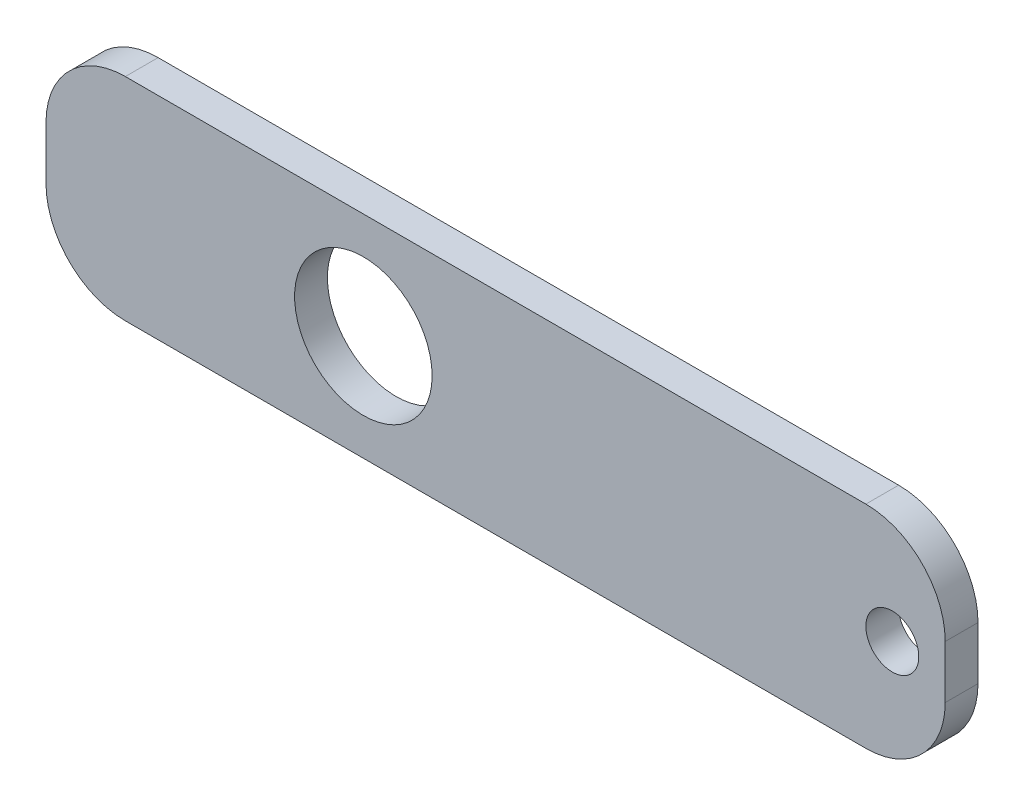
ISO-10303-21;
HEADER;
FILE_DESCRIPTION(('STEP AP214'),'2;1');
FILE_NAME('part.step','',(''),(''),'','','');
FILE_SCHEMA(('AUTOMOTIVE_DESIGN { 1 0 10303 214 1 1 1 1 }'));
ENDSEC;
DATA;
#1=APPLICATION_CONTEXT('core data for automotive mechanical design processes');
#2=APPLICATION_PROTOCOL_DEFINITION('international standard','automotive_design',2000,#1);
#3=PRODUCT_CONTEXT('',#1,'mechanical');
#4=PRODUCT('Part','Part','',(#3));
#5=PRODUCT_RELATED_PRODUCT_CATEGORY('part','',(#4));
#6=PRODUCT_DEFINITION_FORMATION('','',#4);
#7=PRODUCT_DEFINITION_CONTEXT('part definition',#1,'design');
#8=PRODUCT_DEFINITION('design','',#6,#7);
#9=PRODUCT_DEFINITION_SHAPE('','',#8);
#10=(LENGTH_UNIT() NAMED_UNIT(*) SI_UNIT(.MILLI.,.METRE.));
#11=(NAMED_UNIT(*) PLANE_ANGLE_UNIT() SI_UNIT($,.RADIAN.));
#12=(NAMED_UNIT(*) SI_UNIT($,.STERADIAN.) SOLID_ANGLE_UNIT());
#13=UNCERTAINTY_MEASURE_WITH_UNIT(LENGTH_MEASURE(1.E-05),#10,'distance_accuracy_value','');
#14=(GEOMETRIC_REPRESENTATION_CONTEXT(3) GLOBAL_UNCERTAINTY_ASSIGNED_CONTEXT((#13)) GLOBAL_UNIT_ASSIGNED_CONTEXT((#10,
#11,#12)) REPRESENTATION_CONTEXT('',''));
#15=CARTESIAN_POINT('',(0.,0.,0.));
#16=DIRECTION('',(0.,0.,1.));
#17=DIRECTION('',(1.,0.,0.));
#18=AXIS2_PLACEMENT_3D('',#15,#16,#17);
#19=CARTESIAN_POINT('',(0.,0.,3.1));
#20=DIRECTION('',(0.,0.,-1.));
#21=DIRECTION('',(-1.,0.,0.));
#22=AXIS2_PLACEMENT_3D('',#19,#20,#21);
#23=PLANE('',#22);
#24=CARTESIAN_POINT('',(32.3806232903625,0.,3.1));
#25=DIRECTION('',(0.,0.,1.));
#26=DIRECTION('',(-1.,0.,0.));
#27=AXIS2_PLACEMENT_3D('',#24,#25,#26);
#28=CIRCLE('',#27,2.5);
#29=CARTESIAN_POINT('',(29.8806232903625,0.,3.1));
#30=VERTEX_POINT('',#29);
#31=EDGE_CURVE('E134',#30,#30,#28,.T.);
#32=ORIENTED_EDGE('',*,*,#31,.F.);
#33=EDGE_LOOP('',(#32));
#34=FACE_BOUND('',#33,.T.);
#35=DIRECTION('',(0.,-1.,0.));
#36=VECTOR('',#35,1.);
#37=CARTESIAN_POINT('',(-47.6193767096375,-9.99999999999998,3.1));
#38=LINE('',#37,#36);
#39=CARTESIAN_POINT('',(-47.6193767096375,2.50000000000003,3.1));
#40=VERTEX_POINT('',#39);
#41=CARTESIAN_POINT('',(-47.6193767096375,-2.49999999999998,3.1));
#42=VERTEX_POINT('',#41);
#43=EDGE_CURVE('E139',#40,#42,#38,.T.);
#44=ORIENTED_EDGE('',*,*,#43,.T.);
#45=CARTESIAN_POINT('',(-40.1193767096375,-2.49999999999998,3.1));
#46=DIRECTION('',(0.,0.,-1.));
#47=DIRECTION('',(-1.,0.,0.));
#48=AXIS2_PLACEMENT_3D('',#45,#46,#47);
#49=CIRCLE('',#48,7.5);
#50=CARTESIAN_POINT('',(-40.1193767096375,-9.99999999999998,3.1));
#51=VERTEX_POINT('',#50);
#52=EDGE_CURVE('E153',#42,#51,#49,.F.);
#53=ORIENTED_EDGE('',*,*,#52,.T.);
#54=DIRECTION('',(1.,0.,0.));
#55=VECTOR('',#54,1.);
#56=CARTESIAN_POINT('',(-47.6193767096375,-9.99999999999998,3.1));
#57=LINE('',#56,#55);
#58=CARTESIAN_POINT('',(29.8806232903625,-9.99999999999998,3.1));
#59=VERTEX_POINT('',#58);
#60=EDGE_CURVE('E120',#51,#59,#57,.T.);
#61=ORIENTED_EDGE('',*,*,#60,.T.);
#62=CARTESIAN_POINT('',(29.8806232903625,-2.49999999999998,3.1));
#63=DIRECTION('',(0.,0.,-1.));
#64=DIRECTION('',(-1.,0.,0.));
#65=AXIS2_PLACEMENT_3D('',#62,#63,#64);
#66=CIRCLE('',#65,7.5);
#67=CARTESIAN_POINT('',(37.3806232903625,-2.49999999999998,3.1));
#68=VERTEX_POINT('',#67);
#69=EDGE_CURVE('E149',#59,#68,#66,.F.);
#70=ORIENTED_EDGE('',*,*,#69,.T.);
#71=DIRECTION('',(0.,1.,0.));
#72=VECTOR('',#71,1.);
#73=CARTESIAN_POINT('',(37.3806232903625,-9.99999999999998,3.1));
#74=LINE('',#73,#72);
#75=CARTESIAN_POINT('',(37.3806232903625,2.50000000000002,3.1));
#76=VERTEX_POINT('',#75);
#77=EDGE_CURVE('E162',#68,#76,#74,.T.);
#78=ORIENTED_EDGE('',*,*,#77,.T.);
#79=CARTESIAN_POINT('',(29.8806232903625,2.50000000000002,3.1));
#80=DIRECTION('',(0.,0.,-1.));
#81=DIRECTION('',(-1.,0.,0.));
#82=AXIS2_PLACEMENT_3D('',#79,#80,#81);
#83=CIRCLE('',#82,7.5);
#84=CARTESIAN_POINT('',(29.8806232903625,10.,3.1));
#85=VERTEX_POINT('',#84);
#86=EDGE_CURVE('E55',#76,#85,#83,.F.);
#87=ORIENTED_EDGE('',*,*,#86,.T.);
#88=DIRECTION('',(-1.,0.,0.));
#89=VECTOR('',#88,1.);
#90=CARTESIAN_POINT('',(-47.6193767096375,10.,3.1));
#91=LINE('',#90,#89);
#92=CARTESIAN_POINT('',(-40.1193767096375,10.,3.1));
#93=VERTEX_POINT('',#92);
#94=EDGE_CURVE('E140',#85,#93,#91,.T.);
#95=ORIENTED_EDGE('',*,*,#94,.T.);
#96=CARTESIAN_POINT('',(-40.1193767096375,2.50000000000002,3.1));
#97=DIRECTION('',(0.,0.,-1.));
#98=DIRECTION('',(-1.,0.,0.));
#99=AXIS2_PLACEMENT_3D('',#96,#97,#98);
#100=CIRCLE('',#99,7.5);
#101=EDGE_CURVE('E151',#93,#40,#100,.F.);
#102=ORIENTED_EDGE('',*,*,#101,.T.);
#103=EDGE_LOOP('',(#44,#53,#61,#70,#78,#87,#95,#102));
#104=FACE_BOUND('',#103,.T.);
#105=CARTESIAN_POINT('',(-17.6193767096375,0.,3.1));
#106=DIRECTION('',(0.,0.,1.));
#107=DIRECTION('',(1.,0.,0.));
#108=AXIS2_PLACEMENT_3D('',#105,#106,#107);
#109=CIRCLE('',#108,6.5);
#110=CARTESIAN_POINT('',(-11.1193767096375,0.,3.1));
#111=VERTEX_POINT('',#110);
#112=EDGE_CURVE('E185',#111,#111,#109,.T.);
#113=ORIENTED_EDGE('',*,*,#112,.F.);
#114=EDGE_LOOP('',(#113));
#115=FACE_BOUND('',#114,.T.);
#116=ADVANCED_FACE('F33',(#34,#104,#115),#23,.F.);
#117=CARTESIAN_POINT('',(0.,0.,0.));
#118=DIRECTION('',(0.,0.,-1.));
#119=DIRECTION('',(-1.,0.,0.));
#120=AXIS2_PLACEMENT_3D('',#117,#118,#119);
#121=PLANE('',#120);
#122=CARTESIAN_POINT('',(32.3806232903625,0.,0.));
#123=DIRECTION('',(0.,0.,1.));
#124=DIRECTION('',(-1.,0.,0.));
#125=AXIS2_PLACEMENT_3D('',#122,#123,#124);
#126=CIRCLE('',#125,2.5);
#127=CARTESIAN_POINT('',(29.8806232903625,0.,0.));
#128=VERTEX_POINT('',#127);
#129=EDGE_CURVE('E182',#128,#128,#126,.T.);
#130=ORIENTED_EDGE('',*,*,#129,.T.);
#131=EDGE_LOOP('',(#130));
#132=FACE_BOUND('',#131,.T.);
#133=DIRECTION('',(1.,0.,0.));
#134=VECTOR('',#133,1.);
#135=CARTESIAN_POINT('',(-47.6193767096375,-9.99999999999998,0.));
#136=LINE('',#135,#134);
#137=CARTESIAN_POINT('',(-40.1193767096375,-9.99999999999998,0.));
#138=VERTEX_POINT('',#137);
#139=CARTESIAN_POINT('',(29.8806232903625,-9.99999999999998,0.));
#140=VERTEX_POINT('',#139);
#141=EDGE_CURVE('E117',#138,#140,#136,.T.);
#142=ORIENTED_EDGE('',*,*,#141,.F.);
#143=CARTESIAN_POINT('',(-40.1193767096375,-2.49999999999998,0.));
#144=DIRECTION('',(0.,0.,-1.));
#145=DIRECTION('',(-1.,0.,0.));
#146=AXIS2_PLACEMENT_3D('',#143,#144,#145);
#147=CIRCLE('',#146,7.5);
#148=CARTESIAN_POINT('',(-47.6193767096375,-2.49999999999998,0.));
#149=VERTEX_POINT('',#148);
#150=EDGE_CURVE('E100',#138,#149,#147,.T.);
#151=ORIENTED_EDGE('',*,*,#150,.T.);
#152=DIRECTION('',(0.,-1.,0.));
#153=VECTOR('',#152,1.);
#154=CARTESIAN_POINT('',(-47.6193767096375,-9.99999999999998,0.));
#155=LINE('',#154,#153);
#156=CARTESIAN_POINT('',(-47.6193767096375,2.50000000000003,0.));
#157=VERTEX_POINT('',#156);
#158=EDGE_CURVE('E129',#157,#149,#155,.T.);
#159=ORIENTED_EDGE('',*,*,#158,.F.);
#160=CARTESIAN_POINT('',(-40.1193767096375,2.50000000000002,0.));
#161=DIRECTION('',(0.,0.,-1.));
#162=DIRECTION('',(-1.,0.,0.));
#163=AXIS2_PLACEMENT_3D('',#160,#161,#162);
#164=CIRCLE('',#163,7.5);
#165=CARTESIAN_POINT('',(-40.1193767096375,10.,0.));
#166=VERTEX_POINT('',#165);
#167=EDGE_CURVE('E111',#157,#166,#164,.T.);
#168=ORIENTED_EDGE('',*,*,#167,.T.);
#169=DIRECTION('',(-1.,0.,0.));
#170=VECTOR('',#169,1.);
#171=CARTESIAN_POINT('',(-47.6193767096375,10.,0.));
#172=LINE('',#171,#170);
#173=CARTESIAN_POINT('',(29.8806232903625,10.,0.));
#174=VERTEX_POINT('',#173);
#175=EDGE_CURVE('E132',#174,#166,#172,.T.);
#176=ORIENTED_EDGE('',*,*,#175,.F.);
#177=CARTESIAN_POINT('',(29.8806232903625,2.50000000000002,0.));
#178=DIRECTION('',(0.,0.,-1.));
#179=DIRECTION('',(-1.,0.,0.));
#180=AXIS2_PLACEMENT_3D('',#177,#178,#179);
#181=CIRCLE('',#180,7.5);
#182=CARTESIAN_POINT('',(37.3806232903625,2.50000000000002,0.));
#183=VERTEX_POINT('',#182);
#184=EDGE_CURVE('E121',#174,#183,#181,.T.);
#185=ORIENTED_EDGE('',*,*,#184,.T.);
#186=DIRECTION('',(0.,1.,0.));
#187=VECTOR('',#186,1.);
#188=CARTESIAN_POINT('',(37.3806232903625,-9.99999999999998,0.));
#189=LINE('',#188,#187);
#190=CARTESIAN_POINT('',(37.3806232903625,-2.49999999999998,0.));
#191=VERTEX_POINT('',#190);
#192=EDGE_CURVE('E128',#191,#183,#189,.T.);
#193=ORIENTED_EDGE('',*,*,#192,.F.);
#194=CARTESIAN_POINT('',(29.8806232903625,-2.49999999999998,0.));
#195=DIRECTION('',(0.,0.,-1.));
#196=DIRECTION('',(-1.,0.,0.));
#197=AXIS2_PLACEMENT_3D('',#194,#195,#196);
#198=CIRCLE('',#197,7.5);
#199=EDGE_CURVE('E127',#191,#140,#198,.T.);
#200=ORIENTED_EDGE('',*,*,#199,.T.);
#201=EDGE_LOOP('',(#142,#151,#159,#168,#176,#185,#193,#200));
#202=FACE_BOUND('',#201,.T.);
#203=CARTESIAN_POINT('',(-17.6193767096375,0.,0.));
#204=DIRECTION('',(0.,0.,1.));
#205=DIRECTION('',(1.,0.,0.));
#206=AXIS2_PLACEMENT_3D('',#203,#204,#205);
#207=CIRCLE('',#206,6.5);
#208=CARTESIAN_POINT('',(-11.1193767096375,0.,0.));
#209=VERTEX_POINT('',#208);
#210=EDGE_CURVE('E188',#209,#209,#207,.T.);
#211=ORIENTED_EDGE('',*,*,#210,.T.);
#212=EDGE_LOOP('',(#211));
#213=FACE_BOUND('',#212,.T.);
#214=ADVANCED_FACE('F124',(#132,#202,#213),#121,.T.);
#215=CARTESIAN_POINT('',(-47.6193767096375,-9.99999999999998,3.1));
#216=DIRECTION('',(1.,0.,0.));
#217=DIRECTION('',(0.,1.,0.));
#218=AXIS2_PLACEMENT_3D('',#215,#216,#217);
#219=PLANE('',#218);
#220=ORIENTED_EDGE('',*,*,#158,.T.);
#221=DIRECTION('',(0.,0.,-1.));
#222=VECTOR('',#221,1.);
#223=CARTESIAN_POINT('',(-47.6193767096375,-2.49999999999998,3.1));
#224=LINE('',#223,#222);
#225=EDGE_CURVE('E105',#149,#42,#224,.F.);
#226=ORIENTED_EDGE('',*,*,#225,.T.);
#227=ORIENTED_EDGE('',*,*,#43,.F.);
#228=DIRECTION('',(0.,0.,-1.));
#229=VECTOR('',#228,1.);
#230=CARTESIAN_POINT('',(-47.6193767096375,2.50000000000003,3.1));
#231=LINE('',#230,#229);
#232=EDGE_CURVE('E110',#40,#157,#231,.T.);
#233=ORIENTED_EDGE('',*,*,#232,.T.);
#234=EDGE_LOOP('',(#220,#226,#227,#233));
#235=FACE_BOUND('',#234,.T.);
#236=ADVANCED_FACE('F178',(#235),#219,.F.);
#237=CARTESIAN_POINT('',(-47.6193767096375,-9.99999999999998,3.1));
#238=DIRECTION('',(0.,1.,0.));
#239=DIRECTION('',(-1.,0.,0.));
#240=AXIS2_PLACEMENT_3D('',#237,#238,#239);
#241=PLANE('',#240);
#242=ORIENTED_EDGE('',*,*,#60,.F.);
#243=DIRECTION('',(0.,0.,-1.));
#244=VECTOR('',#243,1.);
#245=CARTESIAN_POINT('',(-40.1193767096375,-9.99999999999998,3.1));
#246=LINE('',#245,#244);
#247=EDGE_CURVE('E104',#51,#138,#246,.T.);
#248=ORIENTED_EDGE('',*,*,#247,.T.);
#249=ORIENTED_EDGE('',*,*,#141,.T.);
#250=DIRECTION('',(0.,0.,-1.));
#251=VECTOR('',#250,1.);
#252=CARTESIAN_POINT('',(29.8806232903625,-9.99999999999998,3.1));
#253=LINE('',#252,#251);
#254=EDGE_CURVE('E122',#140,#59,#253,.F.);
#255=ORIENTED_EDGE('',*,*,#254,.T.);
#256=EDGE_LOOP('',(#242,#248,#249,#255));
#257=FACE_BOUND('',#256,.T.);
#258=ADVANCED_FACE('F116',(#257),#241,.F.);
#259=CARTESIAN_POINT('',(37.3806232903625,-9.99999999999998,3.1));
#260=DIRECTION('',(-1.,0.,0.));
#261=DIRECTION('',(0.,0.,1.));
#262=AXIS2_PLACEMENT_3D('',#259,#260,#261);
#263=PLANE('',#262);
#264=ORIENTED_EDGE('',*,*,#77,.F.);
#265=DIRECTION('',(0.,0.,-1.));
#266=VECTOR('',#265,1.);
#267=CARTESIAN_POINT('',(37.3806232903625,-2.49999999999998,3.1));
#268=LINE('',#267,#266);
#269=EDGE_CURVE('E11',#68,#191,#268,.T.);
#270=ORIENTED_EDGE('',*,*,#269,.T.);
#271=ORIENTED_EDGE('',*,*,#192,.T.);
#272=DIRECTION('',(0.,0.,-1.));
#273=VECTOR('',#272,1.);
#274=CARTESIAN_POINT('',(37.3806232903625,2.50000000000002,3.1));
#275=LINE('',#274,#273);
#276=EDGE_CURVE('E41',#183,#76,#275,.F.);
#277=ORIENTED_EDGE('',*,*,#276,.T.);
#278=EDGE_LOOP('',(#264,#270,#271,#277));
#279=FACE_BOUND('',#278,.T.);
#280=ADVANCED_FACE('F161',(#279),#263,.F.);
#281=CARTESIAN_POINT('',(-47.6193767096375,10.,3.1));
#282=DIRECTION('',(0.,-1.,0.));
#283=DIRECTION('',(0.,0.,-1.));
#284=AXIS2_PLACEMENT_3D('',#281,#282,#283);
#285=PLANE('',#284);
#286=ORIENTED_EDGE('',*,*,#175,.T.);
#287=DIRECTION('',(0.,0.,-1.));
#288=VECTOR('',#287,1.);
#289=CARTESIAN_POINT('',(-40.1193767096375,10.,3.1));
#290=LINE('',#289,#288);
#291=EDGE_CURVE('E48',#166,#93,#290,.F.);
#292=ORIENTED_EDGE('',*,*,#291,.T.);
#293=ORIENTED_EDGE('',*,*,#94,.F.);
#294=DIRECTION('',(0.,0.,-1.));
#295=VECTOR('',#294,1.);
#296=CARTESIAN_POINT('',(29.8806232903625,10.,3.1));
#297=LINE('',#296,#295);
#298=EDGE_CURVE('E155',#85,#174,#297,.T.);
#299=ORIENTED_EDGE('',*,*,#298,.T.);
#300=EDGE_LOOP('',(#286,#292,#293,#299));
#301=FACE_BOUND('',#300,.T.);
#302=ADVANCED_FACE('F171',(#301),#285,.F.);
#303=CARTESIAN_POINT('',(32.3806232903625,0.,3.1));
#304=DIRECTION('',(0.,0.,-1.));
#305=DIRECTION('',(-1.,0.,0.));
#306=AXIS2_PLACEMENT_3D('',#303,#304,#305);
#307=CYLINDRICAL_SURFACE('',#306,2.5);
#308=ORIENTED_EDGE('',*,*,#31,.T.);
#309=EDGE_LOOP('',(#308));
#310=FACE_BOUND('',#309,.T.);
#311=ORIENTED_EDGE('',*,*,#129,.F.);
#312=EDGE_LOOP('',(#311));
#313=FACE_BOUND('',#312,.T.);
#314=ADVANCED_FACE('F206',(#310,#313),#307,.F.);
#315=CARTESIAN_POINT('',(-17.6193767096375,0.,3.1));
#316=DIRECTION('',(0.,0.,-1.));
#317=DIRECTION('',(-1.,0.,0.));
#318=AXIS2_PLACEMENT_3D('',#315,#316,#317);
#319=CYLINDRICAL_SURFACE('',#318,6.5);
#320=ORIENTED_EDGE('',*,*,#112,.T.);
#321=EDGE_LOOP('',(#320));
#322=FACE_BOUND('',#321,.T.);
#323=ORIENTED_EDGE('',*,*,#210,.F.);
#324=EDGE_LOOP('',(#323));
#325=FACE_BOUND('',#324,.T.);
#326=ADVANCED_FACE('F194',(#322,#325),#319,.F.);
#327=CARTESIAN_POINT('',(-40.1193767096375,-2.49999999999998,3.1));
#328=DIRECTION('',(0.,0.,-1.));
#329=DIRECTION('',(-1.,0.,0.));
#330=AXIS2_PLACEMENT_3D('',#327,#328,#329);
#331=CYLINDRICAL_SURFACE('',#330,7.5);
#332=ORIENTED_EDGE('',*,*,#52,.F.);
#333=ORIENTED_EDGE('',*,*,#225,.F.);
#334=ORIENTED_EDGE('',*,*,#150,.F.);
#335=ORIENTED_EDGE('',*,*,#247,.F.);
#336=EDGE_LOOP('',(#332,#333,#334,#335));
#337=FACE_BOUND('',#336,.T.);
#338=ADVANCED_FACE('F103',(#337),#331,.T.);
#339=CARTESIAN_POINT('',(-40.1193767096375,2.50000000000002,3.1));
#340=DIRECTION('',(0.,0.,-1.));
#341=DIRECTION('',(-1.,0.,0.));
#342=AXIS2_PLACEMENT_3D('',#339,#340,#341);
#343=CYLINDRICAL_SURFACE('',#342,7.5);
#344=ORIENTED_EDGE('',*,*,#101,.F.);
#345=ORIENTED_EDGE('',*,*,#291,.F.);
#346=ORIENTED_EDGE('',*,*,#167,.F.);
#347=ORIENTED_EDGE('',*,*,#232,.F.);
#348=EDGE_LOOP('',(#344,#345,#346,#347));
#349=FACE_BOUND('',#348,.T.);
#350=ADVANCED_FACE('F175',(#349),#343,.T.);
#351=CARTESIAN_POINT('',(29.8806232903625,-2.49999999999998,3.1));
#352=DIRECTION('',(0.,0.,-1.));
#353=DIRECTION('',(-1.,0.,0.));
#354=AXIS2_PLACEMENT_3D('',#351,#352,#353);
#355=CYLINDRICAL_SURFACE('',#354,7.5);
#356=ORIENTED_EDGE('',*,*,#69,.F.);
#357=ORIENTED_EDGE('',*,*,#254,.F.);
#358=ORIENTED_EDGE('',*,*,#199,.F.);
#359=ORIENTED_EDGE('',*,*,#269,.F.);
#360=EDGE_LOOP('',(#356,#357,#358,#359));
#361=FACE_BOUND('',#360,.T.);
#362=ADVANCED_FACE('F220',(#361),#355,.T.);
#363=CARTESIAN_POINT('',(29.8806232903625,2.50000000000002,3.1));
#364=DIRECTION('',(0.,0.,-1.));
#365=DIRECTION('',(-1.,0.,0.));
#366=AXIS2_PLACEMENT_3D('',#363,#364,#365);
#367=CYLINDRICAL_SURFACE('',#366,7.5);
#368=ORIENTED_EDGE('',*,*,#86,.F.);
#369=ORIENTED_EDGE('',*,*,#276,.F.);
#370=ORIENTED_EDGE('',*,*,#184,.F.);
#371=ORIENTED_EDGE('',*,*,#298,.F.);
#372=EDGE_LOOP('',(#368,#369,#370,#371));
#373=FACE_BOUND('',#372,.T.);
#374=ADVANCED_FACE('F35',(#373),#367,.T.);
#375=CLOSED_SHELL('',(#116,#214,#236,#258,#280,#302,#314,#326,#338,#350,#362,#374));
#376=MANIFOLD_SOLID_BREP('B2',#375);
#377=ADVANCED_BREP_SHAPE_REPRESENTATION('',(#18,#376),#14);
#378=SHAPE_DEFINITION_REPRESENTATION(#9,#377);
ENDSEC;
END-ISO-10303-21;
